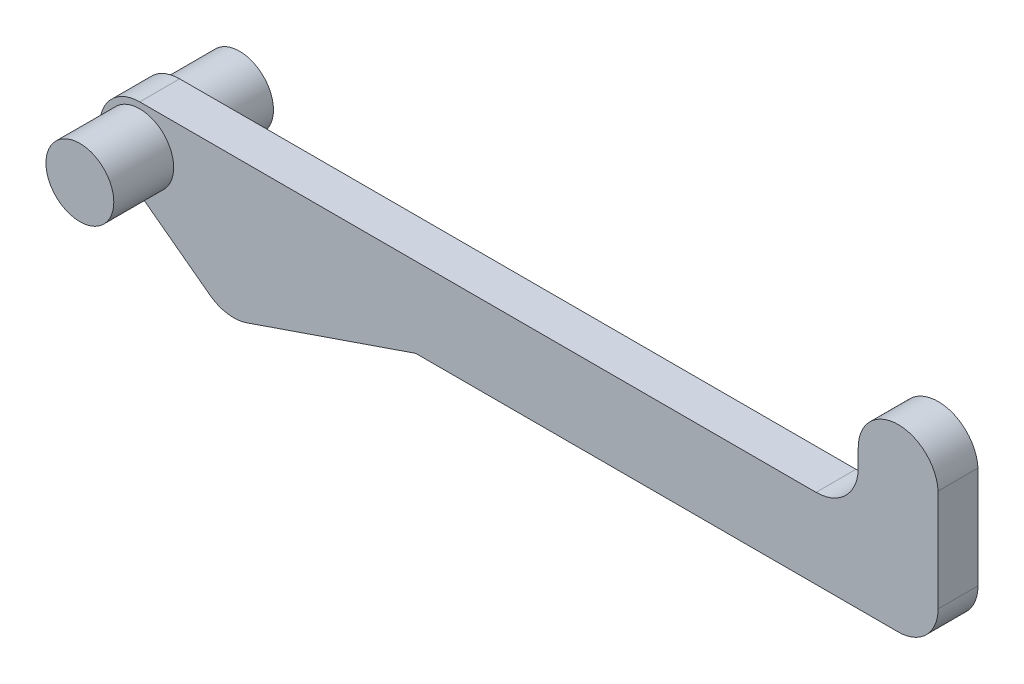
ISO-10303-21;
HEADER;
FILE_DESCRIPTION(('STEP AP214'),'2;1');
FILE_NAME('part.step','',(''),(''),'','','');
FILE_SCHEMA(('AUTOMOTIVE_DESIGN { 1 0 10303 214 1 1 1 1 }'));
ENDSEC;
DATA;
#1=APPLICATION_CONTEXT('core data for automotive mechanical design processes');
#2=APPLICATION_PROTOCOL_DEFINITION('international standard','automotive_design',2000,#1);
#3=PRODUCT_CONTEXT('',#1,'mechanical');
#4=PRODUCT('Part','Part','',(#3));
#5=PRODUCT_RELATED_PRODUCT_CATEGORY('part','',(#4));
#6=PRODUCT_DEFINITION_FORMATION('','',#4);
#7=PRODUCT_DEFINITION_CONTEXT('part definition',#1,'design');
#8=PRODUCT_DEFINITION('design','',#6,#7);
#9=PRODUCT_DEFINITION_SHAPE('','',#8);
#10=(LENGTH_UNIT() NAMED_UNIT(*) SI_UNIT(.MILLI.,.METRE.));
#11=(NAMED_UNIT(*) PLANE_ANGLE_UNIT() SI_UNIT($,.RADIAN.));
#12=(NAMED_UNIT(*) SI_UNIT($,.STERADIAN.) SOLID_ANGLE_UNIT());
#13=UNCERTAINTY_MEASURE_WITH_UNIT(LENGTH_MEASURE(1.E-05),#10,'distance_accuracy_value','');
#14=(GEOMETRIC_REPRESENTATION_CONTEXT(3) GLOBAL_UNCERTAINTY_ASSIGNED_CONTEXT((#13)) GLOBAL_UNIT_ASSIGNED_CONTEXT((#10,
#11,#12)) REPRESENTATION_CONTEXT('',''));
#15=CARTESIAN_POINT('',(0.,0.,0.));
#16=DIRECTION('',(0.,0.,1.));
#17=DIRECTION('',(1.,0.,0.));
#18=AXIS2_PLACEMENT_3D('',#15,#16,#17);
#19=CARTESIAN_POINT('',(81.8847818623521,10.2264545017748,10.));
#20=DIRECTION('',(0.,1.,0.));
#21=DIRECTION('',(-1.,0.,0.));
#22=AXIS2_PLACEMENT_3D('',#19,#20,#21);
#23=PLANE('',#22);
#24=DIRECTION('',(1.,0.,0.));
#25=VECTOR('',#24,1.);
#26=CARTESIAN_POINT('',(81.8847818623521,10.2264545017748,0.));
#27=LINE('',#26,#25);
#28=CARTESIAN_POINT('',(-38.9996533371974,10.2264545017748,0.));
#29=VERTEX_POINT('',#28);
#30=CARTESIAN_POINT('',(81.8847818623521,10.2264545017748,0.));
#31=VERTEX_POINT('',#30);
#32=EDGE_CURVE('E146',#29,#31,#27,.T.);
#33=ORIENTED_EDGE('',*,*,#32,.T.);
#34=DIRECTION('',(0.,0.,-1.));
#35=VECTOR('',#34,1.);
#36=CARTESIAN_POINT('',(81.8847818623521,10.2264545017748,10.));
#37=LINE('',#36,#35);
#38=CARTESIAN_POINT('',(81.8847818623521,10.2264545017748,10.));
#39=VERTEX_POINT('',#38);
#40=EDGE_CURVE('E39',#39,#31,#37,.T.);
#41=ORIENTED_EDGE('',*,*,#40,.F.);
#42=DIRECTION('',(1.,0.,0.));
#43=VECTOR('',#42,1.);
#44=CARTESIAN_POINT('',(81.8847818623521,10.2264545017748,10.));
#45=LINE('',#44,#43);
#46=CARTESIAN_POINT('',(-38.9996533371974,10.2264545017748,10.));
#47=VERTEX_POINT('',#46);
#48=EDGE_CURVE('E167',#47,#39,#45,.T.);
#49=ORIENTED_EDGE('',*,*,#48,.F.);
#50=DIRECTION('',(0.,0.,-1.));
#51=VECTOR('',#50,1.);
#52=CARTESIAN_POINT('',(-38.9996533371974,10.2264545017748,10.));
#53=LINE('',#52,#51);
#54=EDGE_CURVE('E142',#47,#29,#53,.T.);
#55=ORIENTED_EDGE('',*,*,#54,.T.);
#56=EDGE_LOOP('',(#33,#41,#49,#55));
#57=FACE_BOUND('',#56,.T.);
#58=ADVANCED_FACE('F31',(#57),#23,.F.);
#59=CARTESIAN_POINT('',(81.8847818623521,20.2264545017748,10.));
#60=DIRECTION('',(0.,0.,-1.));
#61=DIRECTION('',(-1.,0.,0.));
#62=AXIS2_PLACEMENT_3D('',#59,#60,#61);
#63=CYLINDRICAL_SURFACE('',#62,10.);
#64=CARTESIAN_POINT('',(81.8847818623521,20.2264545017748,0.));
#65=DIRECTION('',(0.,0.,1.));
#66=DIRECTION('',(-1.,0.,0.));
#67=AXIS2_PLACEMENT_3D('',#64,#65,#66);
#68=CIRCLE('',#67,10.);
#69=CARTESIAN_POINT('',(91.8847818623521,20.2264545017748,0.));
#70=VERTEX_POINT('',#69);
#71=EDGE_CURVE('E149',#31,#70,#68,.T.);
#72=ORIENTED_EDGE('',*,*,#71,.T.);
#73=DIRECTION('',(0.,0.,-1.));
#74=VECTOR('',#73,1.);
#75=CARTESIAN_POINT('',(91.8847818623521,20.2264545017748,10.));
#76=LINE('',#75,#74);
#77=CARTESIAN_POINT('',(91.8847818623521,20.2264545017748,10.));
#78=VERTEX_POINT('',#77);
#79=EDGE_CURVE('E186',#78,#70,#76,.T.);
#80=ORIENTED_EDGE('',*,*,#79,.F.);
#81=CARTESIAN_POINT('',(81.8847818623521,20.2264545017748,10.));
#82=DIRECTION('',(0.,0.,1.));
#83=DIRECTION('',(-1.,0.,0.));
#84=AXIS2_PLACEMENT_3D('',#81,#82,#83);
#85=CIRCLE('',#84,10.);
#86=EDGE_CURVE('E100',#39,#78,#85,.T.);
#87=ORIENTED_EDGE('',*,*,#86,.F.);
#88=ORIENTED_EDGE('',*,*,#40,.T.);
#89=EDGE_LOOP('',(#72,#80,#87,#88));
#90=FACE_BOUND('',#89,.T.);
#91=ADVANCED_FACE('F189',(#90),#63,.T.);
#92=CARTESIAN_POINT('',(91.8847818623521,45.7973732039911,10.));
#93=DIRECTION('',(-1.,0.,0.));
#94=DIRECTION('',(0.,0.,1.));
#95=AXIS2_PLACEMENT_3D('',#92,#93,#94);
#96=PLANE('',#95);
#97=DIRECTION('',(0.,1.,0.));
#98=VECTOR('',#97,1.);
#99=CARTESIAN_POINT('',(91.8847818623521,45.7973732039911,0.));
#100=LINE('',#99,#98);
#101=CARTESIAN_POINT('',(91.8847818623521,45.7973732039911,0.));
#102=VERTEX_POINT('',#101);
#103=EDGE_CURVE('E152',#70,#102,#100,.T.);
#104=ORIENTED_EDGE('',*,*,#103,.T.);
#105=DIRECTION('',(0.,0.,-1.));
#106=VECTOR('',#105,1.);
#107=CARTESIAN_POINT('',(91.8847818623521,45.7973732039911,10.));
#108=LINE('',#107,#106);
#109=CARTESIAN_POINT('',(91.8847818623521,45.7973732039911,10.));
#110=VERTEX_POINT('',#109);
#111=EDGE_CURVE('E183',#110,#102,#108,.T.);
#112=ORIENTED_EDGE('',*,*,#111,.F.);
#113=DIRECTION('',(0.,1.,0.));
#114=VECTOR('',#113,1.);
#115=CARTESIAN_POINT('',(91.8847818623521,45.7973732039911,10.));
#116=LINE('',#115,#114);
#117=EDGE_CURVE('E209',#78,#110,#116,.T.);
#118=ORIENTED_EDGE('',*,*,#117,.F.);
#119=ORIENTED_EDGE('',*,*,#79,.T.);
#120=EDGE_LOOP('',(#104,#112,#118,#119));
#121=FACE_BOUND('',#120,.T.);
#122=ADVANCED_FACE('F200',(#121),#96,.F.);
#123=CARTESIAN_POINT('',(81.8929305664656,45.2264545017748,10.));
#124=DIRECTION('',(0.,0.,-1.));
#125=DIRECTION('',(-1.,0.,0.));
#126=AXIS2_PLACEMENT_3D('',#123,#124,#125);
#127=CYLINDRICAL_SURFACE('',#126,10.0081487041135);
#128=CARTESIAN_POINT('',(81.8929305664656,45.2264545017748,0.));
#129=DIRECTION('',(0.,0.,1.));
#130=DIRECTION('',(1.,0.,0.));
#131=AXIS2_PLACEMENT_3D('',#128,#129,#130);
#132=CIRCLE('',#131,10.0081487041135);
#133=CARTESIAN_POINT('',(71.8847818623522,45.2264545017748,0.));
#134=VERTEX_POINT('',#133);
#135=EDGE_CURVE('E154',#102,#134,#132,.T.);
#136=ORIENTED_EDGE('',*,*,#135,.T.);
#137=DIRECTION('',(0.,0.,-1.));
#138=VECTOR('',#137,1.);
#139=CARTESIAN_POINT('',(71.8847818623522,45.2264545017748,10.));
#140=LINE('',#139,#138);
#141=CARTESIAN_POINT('',(71.8847818623522,45.2264545017748,10.));
#142=VERTEX_POINT('',#141);
#143=EDGE_CURVE('E180',#142,#134,#140,.T.);
#144=ORIENTED_EDGE('',*,*,#143,.F.);
#145=CARTESIAN_POINT('',(81.8929305664656,45.2264545017748,10.));
#146=DIRECTION('',(0.,0.,1.));
#147=DIRECTION('',(1.,0.,0.));
#148=AXIS2_PLACEMENT_3D('',#145,#146,#147);
#149=CIRCLE('',#148,10.0081487041135);
#150=EDGE_CURVE('E206',#110,#142,#149,.T.);
#151=ORIENTED_EDGE('',*,*,#150,.F.);
#152=ORIENTED_EDGE('',*,*,#111,.T.);
#153=EDGE_LOOP('',(#136,#144,#151,#152));
#154=FACE_BOUND('',#153,.T.);
#155=ADVANCED_FACE('F204',(#154),#127,.T.);
#156=CARTESIAN_POINT('',(71.8847818623521,40.797373203991,10.));
#157=DIRECTION('',(1.,0.,0.));
#158=DIRECTION('',(0.,1.,0.));
#159=AXIS2_PLACEMENT_3D('',#156,#157,#158);
#160=PLANE('',#159);
#161=DIRECTION('',(0.,-1.,0.));
#162=VECTOR('',#161,1.);
#163=CARTESIAN_POINT('',(71.8847818623521,40.797373203991,0.));
#164=LINE('',#163,#162);
#165=CARTESIAN_POINT('',(71.8847818623521,40.797373203991,0.));
#166=VERTEX_POINT('',#165);
#167=EDGE_CURVE('E156',#134,#166,#164,.T.);
#168=ORIENTED_EDGE('',*,*,#167,.T.);
#169=DIRECTION('',(0.,0.,-1.));
#170=VECTOR('',#169,1.);
#171=CARTESIAN_POINT('',(71.8847818623521,40.797373203991,10.));
#172=LINE('',#171,#170);
#173=CARTESIAN_POINT('',(71.8847818623521,40.797373203991,10.));
#174=VERTEX_POINT('',#173);
#175=EDGE_CURVE('E177',#174,#166,#172,.T.);
#176=ORIENTED_EDGE('',*,*,#175,.F.);
#177=DIRECTION('',(0.,-1.,0.));
#178=VECTOR('',#177,1.);
#179=CARTESIAN_POINT('',(71.8847818623521,40.797373203991,10.));
#180=LINE('',#179,#178);
#181=EDGE_CURVE('E208',#142,#174,#180,.T.);
#182=ORIENTED_EDGE('',*,*,#181,.F.);
#183=ORIENTED_EDGE('',*,*,#143,.T.);
#184=EDGE_LOOP('',(#168,#176,#182,#183));
#185=FACE_BOUND('',#184,.T.);
#186=ADVANCED_FACE('F233',(#185),#160,.F.);
#187=CARTESIAN_POINT('',(61.3138631601358,40.797373203991,10.));
#188=DIRECTION('',(0.,0.,-1.));
#189=DIRECTION('',(-1.,0.,0.));
#190=AXIS2_PLACEMENT_3D('',#187,#188,#189);
#191=CYLINDRICAL_SURFACE('',#190,10.5709187022163);
#192=CARTESIAN_POINT('',(61.3138631601358,40.797373203991,0.));
#193=DIRECTION('',(0.,0.,-1.));
#194=DIRECTION('',(-1.,0.,0.));
#195=AXIS2_PLACEMENT_3D('',#192,#193,#194);
#196=CIRCLE('',#195,10.5709187022163);
#197=CARTESIAN_POINT('',(61.3138631601358,30.2264545017747,0.));
#198=VERTEX_POINT('',#197);
#199=EDGE_CURVE('E158',#166,#198,#196,.T.);
#200=ORIENTED_EDGE('',*,*,#199,.T.);
#201=DIRECTION('',(0.,0.,-1.));
#202=VECTOR('',#201,1.);
#203=CARTESIAN_POINT('',(61.3138631601358,30.2264545017747,10.));
#204=LINE('',#203,#202);
#205=CARTESIAN_POINT('',(61.3138631601358,30.2264545017747,10.));
#206=VERTEX_POINT('',#205);
#207=EDGE_CURVE('E174',#206,#198,#204,.T.);
#208=ORIENTED_EDGE('',*,*,#207,.F.);
#209=CARTESIAN_POINT('',(61.3138631601358,40.797373203991,10.));
#210=DIRECTION('',(0.,0.,-1.));
#211=DIRECTION('',(-1.,0.,0.));
#212=AXIS2_PLACEMENT_3D('',#209,#210,#211);
#213=CIRCLE('',#212,10.5709187022163);
#214=EDGE_CURVE('E211',#174,#206,#213,.T.);
#215=ORIENTED_EDGE('',*,*,#214,.F.);
#216=ORIENTED_EDGE('',*,*,#175,.T.);
#217=EDGE_LOOP('',(#200,#208,#215,#216));
#218=FACE_BOUND('',#217,.T.);
#219=ADVANCED_FACE('F230',(#218),#191,.F.);
#220=CARTESIAN_POINT('',(-108.115218137648,30.2264545017747,10.));
#221=DIRECTION('',(0.,-1.,0.));
#222=DIRECTION('',(1.,0.,0.));
#223=AXIS2_PLACEMENT_3D('',#220,#221,#222);
#224=PLANE('',#223);
#225=DIRECTION('',(-1.,0.,0.));
#226=VECTOR('',#225,1.);
#227=CARTESIAN_POINT('',(-108.115218137648,30.2264545017747,0.));
#228=LINE('',#227,#226);
#229=CARTESIAN_POINT('',(-108.115218137648,30.2264545017747,0.));
#230=VERTEX_POINT('',#229);
#231=EDGE_CURVE('E160',#198,#230,#228,.T.);
#232=ORIENTED_EDGE('',*,*,#231,.T.);
#233=DIRECTION('',(0.,0.,-1.));
#234=VECTOR('',#233,1.);
#235=CARTESIAN_POINT('',(-108.115218137648,30.2264545017747,10.));
#236=LINE('',#235,#234);
#237=CARTESIAN_POINT('',(-108.115218137648,30.2264545017747,10.));
#238=VERTEX_POINT('',#237);
#239=EDGE_CURVE('E171',#238,#230,#236,.T.);
#240=ORIENTED_EDGE('',*,*,#239,.F.);
#241=DIRECTION('',(-1.,0.,0.));
#242=VECTOR('',#241,1.);
#243=CARTESIAN_POINT('',(-108.115218137648,30.2264545017747,10.));
#244=LINE('',#243,#242);
#245=EDGE_CURVE('E217',#206,#238,#244,.T.);
#246=ORIENTED_EDGE('',*,*,#245,.F.);
#247=ORIENTED_EDGE('',*,*,#207,.T.);
#248=EDGE_LOOP('',(#232,#240,#246,#247));
#249=FACE_BOUND('',#248,.T.);
#250=ADVANCED_FACE('F223',(#249),#224,.F.);
#251=CARTESIAN_POINT('',(-108.115218137648,20.2264545017747,10.));
#252=DIRECTION('',(0.,0.,-1.));
#253=DIRECTION('',(-1.,0.,0.));
#254=AXIS2_PLACEMENT_3D('',#251,#252,#253);
#255=CYLINDRICAL_SURFACE('',#254,10.);
#256=CARTESIAN_POINT('',(-108.115218137648,20.2264545017747,0.));
#257=DIRECTION('',(0.,0.,1.));
#258=DIRECTION('',(1.,0.,0.));
#259=AXIS2_PLACEMENT_3D('',#256,#257,#258);
#260=CIRCLE('',#259,10.);
#261=CARTESIAN_POINT('',(-108.115218137648,10.2264545017747,0.));
#262=VERTEX_POINT('',#261);
#263=EDGE_CURVE('E162',#230,#262,#260,.T.);
#264=ORIENTED_EDGE('',*,*,#263,.T.);
#265=DIRECTION('',(0.,0.,-1.));
#266=VECTOR('',#265,1.);
#267=CARTESIAN_POINT('',(-108.115218137648,10.2264545017747,10.));
#268=LINE('',#267,#266);
#269=CARTESIAN_POINT('',(-108.115218137648,10.2264545017747,10.));
#270=VERTEX_POINT('',#269);
#271=EDGE_CURVE('E137',#270,#262,#268,.T.);
#272=ORIENTED_EDGE('',*,*,#271,.F.);
#273=CARTESIAN_POINT('',(-108.115218137648,20.2264545017747,10.));
#274=DIRECTION('',(0.,0.,1.));
#275=DIRECTION('',(1.,0.,0.));
#276=AXIS2_PLACEMENT_3D('',#273,#274,#275);
#277=CIRCLE('',#276,10.);
#278=EDGE_CURVE('E128',#238,#270,#277,.T.);
#279=ORIENTED_EDGE('',*,*,#278,.F.);
#280=ORIENTED_EDGE('',*,*,#239,.T.);
#281=EDGE_LOOP('',(#264,#272,#279,#280));
#282=FACE_BOUND('',#281,.T.);
#283=ADVANCED_FACE('F227',(#282),#255,.T.);
#284=CARTESIAN_POINT('',(-90.5667047047966,-2.87035635083817,10.));
#285=DIRECTION('',(0.598110967547573,0.801413295684135,0.));
#286=DIRECTION('',(-0.801413295684135,0.598110967547573,0.));
#287=AXIS2_PLACEMENT_3D('',#284,#285,#286);
#288=PLANE('',#287);
#289=DIRECTION('',(0.801413295684135,-0.598110967547573,0.));
#290=VECTOR('',#289,1.);
#291=CARTESIAN_POINT('',(-90.5667047047966,-2.87035635083817,0.));
#292=LINE('',#291,#290);
#293=CARTESIAN_POINT('',(-90.5667047047966,-2.87035635083812,0.));
#294=VERTEX_POINT('',#293);
#295=EDGE_CURVE('E136',#262,#294,#292,.T.);
#296=ORIENTED_EDGE('',*,*,#295,.T.);
#297=DIRECTION('',(0.,0.,-1.));
#298=VECTOR('',#297,1.);
#299=CARTESIAN_POINT('',(-90.5667047047966,-2.87035635083812,10.));
#300=LINE('',#299,#298);
#301=CARTESIAN_POINT('',(-90.5667047047966,-2.87035635083812,10.));
#302=VERTEX_POINT('',#301);
#303=EDGE_CURVE('E133',#302,#294,#300,.T.);
#304=ORIENTED_EDGE('',*,*,#303,.F.);
#305=DIRECTION('',(0.801413295684135,-0.598110967547573,0.));
#306=VECTOR('',#305,1.);
#307=CARTESIAN_POINT('',(-90.5667047047966,-2.87035635083817,10.));
#308=LINE('',#307,#306);
#309=EDGE_CURVE('E122',#270,#302,#308,.T.);
#310=ORIENTED_EDGE('',*,*,#309,.F.);
#311=ORIENTED_EDGE('',*,*,#271,.T.);
#312=EDGE_LOOP('',(#296,#304,#310,#311));
#313=FACE_BOUND('',#312,.T.);
#314=ADVANCED_FACE('F134',(#313),#288,.F.);
#315=CARTESIAN_POINT('',(-84.5855950293209,5.14377660600319,10.));
#316=DIRECTION('',(0.,0.,-1.));
#317=DIRECTION('',(-1.,0.,0.));
#318=AXIS2_PLACEMENT_3D('',#315,#316,#317);
#319=CYLINDRICAL_SURFACE('',#318,9.99999999999995);
#320=CARTESIAN_POINT('',(-84.5855950293209,5.14377660600319,0.));
#321=DIRECTION('',(0.,0.,1.));
#322=DIRECTION('',(-1.,0.,0.));
#323=AXIS2_PLACEMENT_3D('',#320,#321,#322);
#324=CIRCLE('',#323,9.99999999999995);
#325=CARTESIAN_POINT('',(-81.3374270478597,-4.31399293888468,0.));
#326=VERTEX_POINT('',#325);
#327=EDGE_CURVE('E85',#294,#326,#324,.T.);
#328=ORIENTED_EDGE('',*,*,#327,.T.);
#329=DIRECTION('',(0.,0.,-1.));
#330=VECTOR('',#329,1.);
#331=CARTESIAN_POINT('',(-81.3374270478597,-4.31399293888468,10.));
#332=LINE('',#331,#330);
#333=CARTESIAN_POINT('',(-81.3374270478597,-4.31399293888468,10.));
#334=VERTEX_POINT('',#333);
#335=EDGE_CURVE('E138',#334,#326,#332,.T.);
#336=ORIENTED_EDGE('',*,*,#335,.F.);
#337=CARTESIAN_POINT('',(-84.5855950293209,5.14377660600319,10.));
#338=DIRECTION('',(0.,0.,1.));
#339=DIRECTION('',(-1.,0.,0.));
#340=AXIS2_PLACEMENT_3D('',#337,#338,#339);
#341=CIRCLE('',#340,9.99999999999995);
#342=EDGE_CURVE('E126',#302,#334,#341,.T.);
#343=ORIENTED_EDGE('',*,*,#342,.F.);
#344=ORIENTED_EDGE('',*,*,#303,.T.);
#345=EDGE_LOOP('',(#328,#336,#343,#344));
#346=FACE_BOUND('',#345,.T.);
#347=ADVANCED_FACE('F140',(#346),#319,.T.);
#348=CARTESIAN_POINT('',(-38.9996533371974,10.2264545017748,10.));
#349=DIRECTION('',(-0.324816798146098,0.945776954488804,0.));
#350=DIRECTION('',(-0.945776954488804,-0.324816798146098,0.));
#351=AXIS2_PLACEMENT_3D('',#348,#349,#350);
#352=PLANE('',#351);
#353=DIRECTION('',(0.945776954488804,0.324816798146098,0.));
#354=VECTOR('',#353,1.);
#355=CARTESIAN_POINT('',(-38.9996533371974,10.2264545017748,0.));
#356=LINE('',#355,#354);
#357=EDGE_CURVE('E91',#326,#29,#356,.T.);
#358=ORIENTED_EDGE('',*,*,#357,.T.);
#359=ORIENTED_EDGE('',*,*,#54,.F.);
#360=DIRECTION('',(0.945776954488804,0.324816798146098,0.));
#361=VECTOR('',#360,1.);
#362=CARTESIAN_POINT('',(-38.9996533371974,10.2264545017748,10.));
#363=LINE('',#362,#361);
#364=EDGE_CURVE('E47',#334,#47,#363,.T.);
#365=ORIENTED_EDGE('',*,*,#364,.F.);
#366=ORIENTED_EDGE('',*,*,#335,.T.);
#367=EDGE_LOOP('',(#358,#359,#365,#366));
#368=FACE_BOUND('',#367,.T.);
#369=ADVANCED_FACE('F299',(#368),#352,.F.);
#370=CARTESIAN_POINT('',(-84.5855950293209,5.14377660600319,10.));
#371=DIRECTION('',(0.,0.,-1.));
#372=DIRECTION('',(-1.,0.,0.));
#373=AXIS2_PLACEMENT_3D('',#370,#371,#372);
#374=PLANE('',#373);
#375=CARTESIAN_POINT('',(-108.115218137648,20.2264545017747,10.));
#376=DIRECTION('',(0.,0.,-1.));
#377=DIRECTION('',(-1.,0.,0.));
#378=AXIS2_PLACEMENT_3D('',#375,#376,#377);
#379=CIRCLE('',#378,8.50000000000001);
#380=CARTESIAN_POINT('',(-116.615218137648,20.2264545017747,10.));
#381=VERTEX_POINT('',#380);
#382=EDGE_CURVE('E150',#381,#381,#379,.T.);
#383=ORIENTED_EDGE('',*,*,#382,.T.);
#384=EDGE_LOOP('',(#383));
#385=FACE_BOUND('',#384,.T.);
#386=ORIENTED_EDGE('',*,*,#48,.T.);
#387=ORIENTED_EDGE('',*,*,#86,.T.);
#388=ORIENTED_EDGE('',*,*,#117,.T.);
#389=ORIENTED_EDGE('',*,*,#150,.T.);
#390=ORIENTED_EDGE('',*,*,#181,.T.);
#391=ORIENTED_EDGE('',*,*,#214,.T.);
#392=ORIENTED_EDGE('',*,*,#245,.T.);
#393=ORIENTED_EDGE('',*,*,#278,.T.);
#394=ORIENTED_EDGE('',*,*,#309,.T.);
#395=ORIENTED_EDGE('',*,*,#342,.T.);
#396=ORIENTED_EDGE('',*,*,#364,.T.);
#397=EDGE_LOOP('',(#386,#387,#388,#389,#390,#391,#392,#393,#394,#395,#396));
#398=FACE_BOUND('',#397,.T.);
#399=ADVANCED_FACE('F124',(#385,#398),#374,.F.);
#400=CARTESIAN_POINT('',(-84.5855950293209,5.14377660600319,0.));
#401=DIRECTION('',(0.,0.,-1.));
#402=DIRECTION('',(-1.,0.,0.));
#403=AXIS2_PLACEMENT_3D('',#400,#401,#402);
#404=PLANE('',#403);
#405=CARTESIAN_POINT('',(-108.115218137648,20.2264545017747,0.));
#406=DIRECTION('',(0.,0.,-1.));
#407=DIRECTION('',(-1.,0.,0.));
#408=AXIS2_PLACEMENT_3D('',#405,#406,#407);
#409=CIRCLE('',#408,8.50000000000001);
#410=CARTESIAN_POINT('',(-116.615218137648,20.2264545017747,0.));
#411=VERTEX_POINT('',#410);
#412=EDGE_CURVE('E11',#411,#411,#409,.T.);
#413=ORIENTED_EDGE('',*,*,#412,.F.);
#414=EDGE_LOOP('',(#413));
#415=FACE_BOUND('',#414,.T.);
#416=ORIENTED_EDGE('',*,*,#32,.F.);
#417=ORIENTED_EDGE('',*,*,#357,.F.);
#418=ORIENTED_EDGE('',*,*,#327,.F.);
#419=ORIENTED_EDGE('',*,*,#295,.F.);
#420=ORIENTED_EDGE('',*,*,#263,.F.);
#421=ORIENTED_EDGE('',*,*,#231,.F.);
#422=ORIENTED_EDGE('',*,*,#199,.F.);
#423=ORIENTED_EDGE('',*,*,#167,.F.);
#424=ORIENTED_EDGE('',*,*,#135,.F.);
#425=ORIENTED_EDGE('',*,*,#103,.F.);
#426=ORIENTED_EDGE('',*,*,#71,.F.);
#427=EDGE_LOOP('',(#416,#417,#418,#419,#420,#421,#422,#423,#424,#425,#426));
#428=FACE_BOUND('',#427,.T.);
#429=ADVANCED_FACE('F194',(#415,#428),#404,.T.);
#430=CARTESIAN_POINT('',(-108.115218137648,20.2264545017747,-15.));
#431=DIRECTION('',(0.,0.,1.));
#432=DIRECTION('',(1.,0.,0.));
#433=AXIS2_PLACEMENT_3D('',#430,#431,#432);
#434=PLANE('',#433);
#435=CARTESIAN_POINT('',(-108.115218137648,20.2264545017747,-15.));
#436=DIRECTION('',(0.,0.,1.));
#437=DIRECTION('',(1.,0.,0.));
#438=AXIS2_PLACEMENT_3D('',#435,#436,#437);
#439=CIRCLE('',#438,8.50000000000001);
#440=CARTESIAN_POINT('',(-99.6152181376479,20.2264545017747,-15.));
#441=VERTEX_POINT('',#440);
#442=EDGE_CURVE('E371',#441,#441,#439,.T.);
#443=ORIENTED_EDGE('',*,*,#442,.F.);
#444=EDGE_LOOP('',(#443));
#445=FACE_BOUND('',#444,.T.);
#446=ADVANCED_FACE('F325',(#445),#434,.F.);
#447=CARTESIAN_POINT('',(-108.115218137648,20.2264545017747,-15.));
#448=DIRECTION('',(0.,0.,1.));
#449=DIRECTION('',(1.,0.,0.));
#450=AXIS2_PLACEMENT_3D('',#447,#448,#449);
#451=CYLINDRICAL_SURFACE('',#450,8.50000000000001);
#452=ORIENTED_EDGE('',*,*,#412,.T.);
#453=EDGE_LOOP('',(#452));
#454=FACE_BOUND('',#453,.T.);
#455=ORIENTED_EDGE('',*,*,#442,.T.);
#456=EDGE_LOOP('',(#455));
#457=FACE_BOUND('',#456,.T.);
#458=ADVANCED_FACE('F335',(#454,#457),#451,.T.);
#459=CARTESIAN_POINT('',(-108.115218137648,20.2264545017747,25.));
#460=DIRECTION('',(0.,0.,1.));
#461=DIRECTION('',(1.,0.,0.));
#462=AXIS2_PLACEMENT_3D('',#459,#460,#461);
#463=CIRCLE('',#462,8.50000000000001);
#464=CARTESIAN_POINT('',(-99.6152181376479,20.2264545017747,25.));
#465=VERTEX_POINT('',#464);
#466=EDGE_CURVE('E370',#465,#465,#463,.T.);
#467=ORIENTED_EDGE('',*,*,#466,.F.);
#468=EDGE_LOOP('',(#467));
#469=FACE_BOUND('',#468,.T.);
#470=ORIENTED_EDGE('',*,*,#382,.F.);
#471=EDGE_LOOP('',(#470));
#472=FACE_BOUND('',#471,.T.);
#473=ADVANCED_FACE('F345',(#469,#472),#451,.T.);
#474=CARTESIAN_POINT('',(-108.115218137648,20.2264545017747,25.));
#475=DIRECTION('',(0.,0.,1.));
#476=DIRECTION('',(1.,0.,0.));
#477=AXIS2_PLACEMENT_3D('',#474,#475,#476);
#478=PLANE('',#477);
#479=ORIENTED_EDGE('',*,*,#466,.T.);
#480=EDGE_LOOP('',(#479));
#481=FACE_BOUND('',#480,.T.);
#482=ADVANCED_FACE('F355',(#481),#478,.T.);
#483=CLOSED_SHELL('',(#58,#91,#122,#155,#186,#219,#250,#283,#314,#347,#369,#399,#429,#446,#458,
#473,#482));
#484=MANIFOLD_SOLID_BREP('B2',#483);
#485=ADVANCED_BREP_SHAPE_REPRESENTATION('',(#18,#484),#14);
#486=SHAPE_DEFINITION_REPRESENTATION(#9,#485);
ENDSEC;
END-ISO-10303-21;
